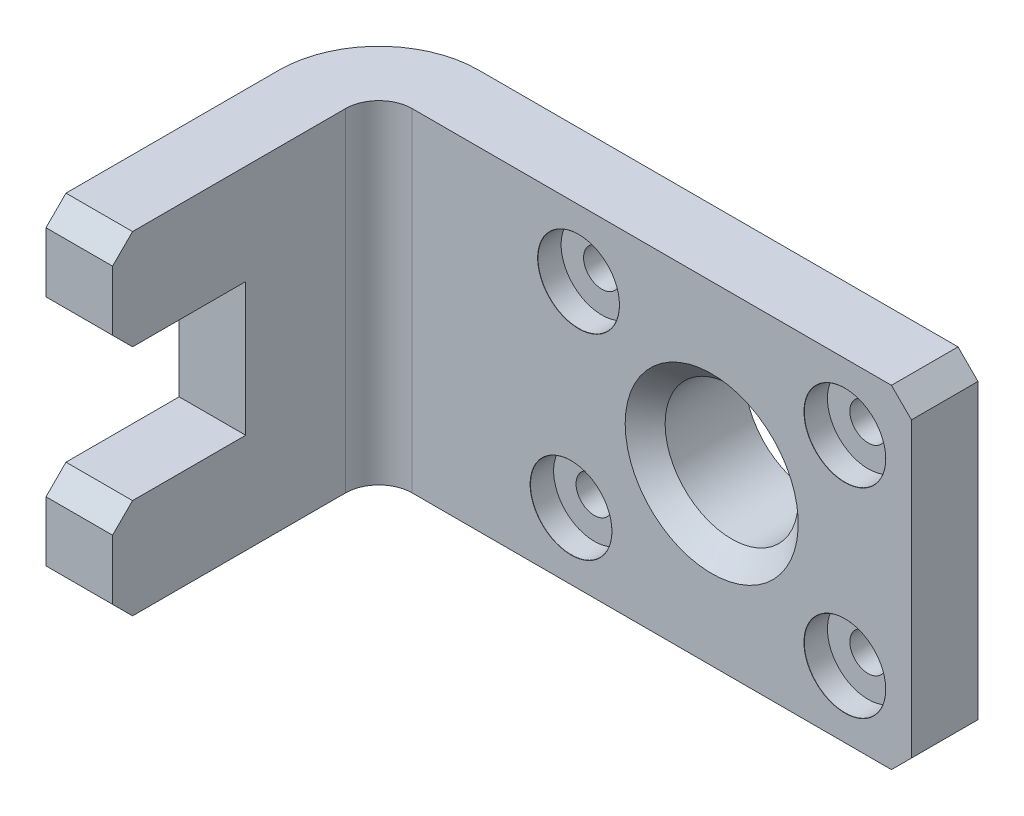
ISO-10303-21;
HEADER;
FILE_DESCRIPTION(('STEP AP214'),'2;1');
FILE_NAME('part.step','',(''),(''),'','','');
FILE_SCHEMA(('AUTOMOTIVE_DESIGN { 1 0 10303 214 1 1 1 1 }'));
ENDSEC;
DATA;
#1=APPLICATION_CONTEXT('core data for automotive mechanical design processes');
#2=APPLICATION_PROTOCOL_DEFINITION('international standard','automotive_design',2000,#1);
#3=PRODUCT_CONTEXT('',#1,'mechanical');
#4=PRODUCT('Part','Part','',(#3));
#5=PRODUCT_RELATED_PRODUCT_CATEGORY('part','',(#4));
#6=PRODUCT_DEFINITION_FORMATION('','',#4);
#7=PRODUCT_DEFINITION_CONTEXT('part definition',#1,'design');
#8=PRODUCT_DEFINITION('design','',#6,#7);
#9=PRODUCT_DEFINITION_SHAPE('','',#8);
#10=(LENGTH_UNIT() NAMED_UNIT(*) SI_UNIT(.MILLI.,.METRE.));
#11=(NAMED_UNIT(*) PLANE_ANGLE_UNIT() SI_UNIT($,.RADIAN.));
#12=(NAMED_UNIT(*) SI_UNIT($,.STERADIAN.) SOLID_ANGLE_UNIT());
#13=UNCERTAINTY_MEASURE_WITH_UNIT(LENGTH_MEASURE(1.E-05),#10,'distance_accuracy_value','');
#14=(GEOMETRIC_REPRESENTATION_CONTEXT(3) GLOBAL_UNCERTAINTY_ASSIGNED_CONTEXT((#13)) GLOBAL_UNIT_ASSIGNED_CONTEXT((#10,
#11,#12)) REPRESENTATION_CONTEXT('',''));
#15=CARTESIAN_POINT('',(0.,0.,0.));
#16=DIRECTION('',(0.,0.,1.));
#17=DIRECTION('',(1.,0.,0.));
#18=AXIS2_PLACEMENT_3D('',#15,#16,#17);
#19=CARTESIAN_POINT('',(0.,0.,0.));
#20=DIRECTION('',(1.,0.,0.));
#21=DIRECTION('',(0.,0.,-1.));
#22=AXIS2_PLACEMENT_3D('',#19,#20,#21);
#23=PLANE('',#22);
#24=DIRECTION('',(0.,0.,1.));
#25=VECTOR('',#24,1.);
#26=CARTESIAN_POINT('',(0.,0.,0.));
#27=LINE('',#26,#25);
#28=CARTESIAN_POINT('',(0.,0.,15.));
#29=VERTEX_POINT('',#28);
#30=CARTESIAN_POINT('',(0.,0.,47.));
#31=VERTEX_POINT('',#30);
#32=EDGE_CURVE('E235',#29,#31,#27,.T.);
#33=ORIENTED_EDGE('',*,*,#32,.F.);
#34=DIRECTION('',(0.,-1.,0.));
#35=VECTOR('',#34,1.);
#36=CARTESIAN_POINT('',(0.,0.,15.));
#37=LINE('',#36,#35);
#38=CARTESIAN_POINT('',(0.,50.,15.));
#39=VERTEX_POINT('',#38);
#40=EDGE_CURVE('E385',#29,#39,#37,.F.);
#41=ORIENTED_EDGE('',*,*,#40,.T.);
#42=DIRECTION('',(0.,0.,-1.));
#43=VECTOR('',#42,1.);
#44=CARTESIAN_POINT('',(0.,50.,0.));
#45=LINE('',#44,#43);
#46=CARTESIAN_POINT('',(0.,50.,47.));
#47=VERTEX_POINT('',#46);
#48=EDGE_CURVE('E227',#47,#39,#45,.T.);
#49=ORIENTED_EDGE('',*,*,#48,.F.);
#50=DIRECTION('',(0.,0.707106781186551,-0.707106781186544));
#51=VECTOR('',#50,1.);
#52=CARTESIAN_POINT('',(0.,48.4999999999998,48.5000000000002));
#53=LINE('',#52,#51);
#54=CARTESIAN_POINT('',(0.,47.,50.));
#55=VERTEX_POINT('',#54);
#56=EDGE_CURVE('E303',#47,#55,#53,.F.);
#57=ORIENTED_EDGE('',*,*,#56,.T.);
#58=DIRECTION('',(0.,1.,0.));
#59=VECTOR('',#58,1.);
#60=CARTESIAN_POINT('',(0.,0.,50.));
#61=LINE('',#60,#59);
#62=CARTESIAN_POINT('',(0.,38.,50.));
#63=VERTEX_POINT('',#62);
#64=EDGE_CURVE('E238',#63,#55,#61,.T.);
#65=ORIENTED_EDGE('',*,*,#64,.F.);
#66=DIRECTION('',(0.,-0.707106781186544,-0.707106781186551));
#67=VECTOR('',#66,1.);
#68=CARTESIAN_POINT('',(0.,-5.99999999999983,5.99999999999977));
#69=LINE('',#68,#67);
#70=CARTESIAN_POINT('',(0.,35.,47.));
#71=VERTEX_POINT('',#70);
#72=EDGE_CURVE('E318',#63,#71,#69,.T.);
#73=ORIENTED_EDGE('',*,*,#72,.T.);
#74=DIRECTION('',(0.,0.,1.));
#75=VECTOR('',#74,1.);
#76=CARTESIAN_POINT('',(0.,35.,30.));
#77=LINE('',#76,#75);
#78=CARTESIAN_POINT('',(0.,35.,30.));
#79=VERTEX_POINT('',#78);
#80=EDGE_CURVE('E218',#79,#71,#77,.T.);
#81=ORIENTED_EDGE('',*,*,#80,.F.);
#82=DIRECTION('',(0.,-1.,0.));
#83=VECTOR('',#82,1.);
#84=CARTESIAN_POINT('',(0.,35.,30.));
#85=LINE('',#84,#83);
#86=CARTESIAN_POINT('',(0.,15.,30.));
#87=VERTEX_POINT('',#86);
#88=EDGE_CURVE('E196',#79,#87,#85,.T.);
#89=ORIENTED_EDGE('',*,*,#88,.T.);
#90=DIRECTION('',(0.,0.,1.));
#91=VECTOR('',#90,1.);
#92=CARTESIAN_POINT('',(0.,15.,30.));
#93=LINE('',#92,#91);
#94=CARTESIAN_POINT('',(0.,15.,47.));
#95=VERTEX_POINT('',#94);
#96=EDGE_CURVE('E191',#87,#95,#93,.T.);
#97=ORIENTED_EDGE('',*,*,#96,.T.);
#98=DIRECTION('',(0.,0.707106781186551,-0.707106781186544));
#99=VECTOR('',#98,1.);
#100=CARTESIAN_POINT('',(0.,30.9999999999999,31.0000000000002));
#101=LINE('',#100,#99);
#102=CARTESIAN_POINT('',(0.,12.,50.));
#103=VERTEX_POINT('',#102);
#104=EDGE_CURVE('E366',#95,#103,#101,.F.);
#105=ORIENTED_EDGE('',*,*,#104,.T.);
#106=CARTESIAN_POINT('',(0.,3.,50.));
#107=VERTEX_POINT('',#106);
#108=EDGE_CURVE('E240',#107,#103,#61,.T.);
#109=ORIENTED_EDGE('',*,*,#108,.F.);
#110=DIRECTION('',(0.,0.707106781186544,0.707106781186551));
#111=VECTOR('',#110,1.);
#112=CARTESIAN_POINT('',(0.,-23.5,23.4999999999998));
#113=LINE('',#112,#111);
#114=EDGE_CURVE('E369',#107,#31,#113,.F.);
#115=ORIENTED_EDGE('',*,*,#114,.T.);
#116=EDGE_LOOP('',(#33,#41,#49,#57,#65,#73,#81,#89,#97,#105,#109,#115));
#117=FACE_BOUND('',#116,.T.);
#118=ADVANCED_FACE('F58',(#117),#23,.T.);
#119=CARTESIAN_POINT('',(-10.,0.,50.));
#120=DIRECTION('',(0.,0.,-1.));
#121=DIRECTION('',(-1.,0.,0.));
#122=AXIS2_PLACEMENT_3D('',#119,#120,#121);
#123=PLANE('',#122);
#124=DIRECTION('',(0.,1.,0.));
#125=VECTOR('',#124,1.);
#126=CARTESIAN_POINT('',(-10.,0.,50.));
#127=LINE('',#126,#125);
#128=CARTESIAN_POINT('',(-10.,38.,50.));
#129=VERTEX_POINT('',#128);
#130=CARTESIAN_POINT('',(-10.,47.,50.));
#131=VERTEX_POINT('',#130);
#132=EDGE_CURVE('E226',#129,#131,#127,.T.);
#133=ORIENTED_EDGE('',*,*,#132,.F.);
#134=DIRECTION('',(1.,0.,0.));
#135=VECTOR('',#134,1.);
#136=CARTESIAN_POINT('',(0.,38.,50.));
#137=LINE('',#136,#135);
#138=EDGE_CURVE('E314',#129,#63,#137,.T.);
#139=ORIENTED_EDGE('',*,*,#138,.T.);
#140=ORIENTED_EDGE('',*,*,#64,.T.);
#141=DIRECTION('',(-1.,0.,0.));
#142=VECTOR('',#141,1.);
#143=CARTESIAN_POINT('',(-10.,47.,50.));
#144=LINE('',#143,#142);
#145=EDGE_CURVE('E307',#55,#131,#144,.T.);
#146=ORIENTED_EDGE('',*,*,#145,.T.);
#147=EDGE_LOOP('',(#133,#139,#140,#146));
#148=FACE_BOUND('',#147,.T.);
#149=ADVANCED_FACE('F698',(#148),#123,.F.);
#150=CARTESIAN_POINT('',(-10.,0.,0.));
#151=DIRECTION('',(1.,0.,0.));
#152=DIRECTION('',(0.,0.,-1.));
#153=AXIS2_PLACEMENT_3D('',#150,#151,#152);
#154=PLANE('',#153);
#155=DIRECTION('',(0.,0.,-1.));
#156=VECTOR('',#155,1.);
#157=CARTESIAN_POINT('',(-10.,50.,0.));
#158=LINE('',#157,#156);
#159=CARTESIAN_POINT('',(-10.,50.,47.));
#160=VERTEX_POINT('',#159);
#161=CARTESIAN_POINT('',(-10.,50.,15.));
#162=VERTEX_POINT('',#161);
#163=EDGE_CURVE('E231',#160,#162,#158,.T.);
#164=ORIENTED_EDGE('',*,*,#163,.T.);
#165=DIRECTION('',(0.,-1.,0.));
#166=VECTOR('',#165,1.);
#167=CARTESIAN_POINT('',(-10.,0.,15.));
#168=LINE('',#167,#166);
#169=CARTESIAN_POINT('',(-10.,0.,15.));
#170=VERTEX_POINT('',#169);
#171=EDGE_CURVE('E394',#162,#170,#168,.T.);
#172=ORIENTED_EDGE('',*,*,#171,.T.);
#173=DIRECTION('',(0.,0.,1.));
#174=VECTOR('',#173,1.);
#175=CARTESIAN_POINT('',(-10.,0.,0.));
#176=LINE('',#175,#174);
#177=CARTESIAN_POINT('',(-10.,0.,47.));
#178=VERTEX_POINT('',#177);
#179=EDGE_CURVE('E223',#170,#178,#176,.T.);
#180=ORIENTED_EDGE('',*,*,#179,.T.);
#181=DIRECTION('',(0.,-0.707106781186544,-0.707106781186551));
#182=VECTOR('',#181,1.);
#183=CARTESIAN_POINT('',(-10.,3.,50.));
#184=LINE('',#183,#182);
#185=CARTESIAN_POINT('',(-10.,3.,50.));
#186=VERTEX_POINT('',#185);
#187=EDGE_CURVE('E375',#178,#186,#184,.F.);
#188=ORIENTED_EDGE('',*,*,#187,.T.);
#189=CARTESIAN_POINT('',(-10.,12.,50.));
#190=VERTEX_POINT('',#189);
#191=EDGE_CURVE('E228',#186,#190,#127,.T.);
#192=ORIENTED_EDGE('',*,*,#191,.T.);
#193=DIRECTION('',(0.,-0.707106781186551,0.707106781186544));
#194=VECTOR('',#193,1.);
#195=CARTESIAN_POINT('',(-10.,15.,47.));
#196=LINE('',#195,#194);
#197=CARTESIAN_POINT('',(-10.,15.,47.));
#198=VERTEX_POINT('',#197);
#199=EDGE_CURVE('E212',#190,#198,#196,.F.);
#200=ORIENTED_EDGE('',*,*,#199,.T.);
#201=DIRECTION('',(0.,0.,1.));
#202=VECTOR('',#201,1.);
#203=CARTESIAN_POINT('',(-10.,15.,30.));
#204=LINE('',#203,#202);
#205=CARTESIAN_POINT('',(-10.,15.,30.));
#206=VERTEX_POINT('',#205);
#207=EDGE_CURVE('E188',#206,#198,#204,.T.);
#208=ORIENTED_EDGE('',*,*,#207,.F.);
#209=DIRECTION('',(0.,-1.,0.));
#210=VECTOR('',#209,1.);
#211=CARTESIAN_POINT('',(-10.,35.,30.));
#212=LINE('',#211,#210);
#213=CARTESIAN_POINT('',(-10.,35.,30.));
#214=VERTEX_POINT('',#213);
#215=EDGE_CURVE('E197',#214,#206,#212,.T.);
#216=ORIENTED_EDGE('',*,*,#215,.F.);
#217=DIRECTION('',(0.,0.,1.));
#218=VECTOR('',#217,1.);
#219=CARTESIAN_POINT('',(-10.,35.,30.));
#220=LINE('',#219,#218);
#221=CARTESIAN_POINT('',(-10.,35.,47.));
#222=VERTEX_POINT('',#221);
#223=EDGE_CURVE('E239',#214,#222,#220,.T.);
#224=ORIENTED_EDGE('',*,*,#223,.T.);
#225=DIRECTION('',(0.,0.707106781186544,0.707106781186551));
#226=VECTOR('',#225,1.);
#227=CARTESIAN_POINT('',(-10.,38.,50.));
#228=LINE('',#227,#226);
#229=EDGE_CURVE('E324',#222,#129,#228,.T.);
#230=ORIENTED_EDGE('',*,*,#229,.T.);
#231=ORIENTED_EDGE('',*,*,#132,.T.);
#232=DIRECTION('',(0.,-0.707106781186551,0.707106781186544));
#233=VECTOR('',#232,1.);
#234=CARTESIAN_POINT('',(-10.,50.,47.));
#235=LINE('',#234,#233);
#236=EDGE_CURVE('E311',#131,#160,#235,.F.);
#237=ORIENTED_EDGE('',*,*,#236,.T.);
#238=EDGE_LOOP('',(#164,#172,#180,#188,#192,#200,#208,#216,#224,#230,#231,#237));
#239=FACE_BOUND('',#238,.T.);
#240=ADVANCED_FACE('F209',(#239),#154,.F.);
#241=CARTESIAN_POINT('',(0.,0.,10.));
#242=DIRECTION('',(0.,1.,0.));
#243=DIRECTION('',(0.,0.,1.));
#244=AXIS2_PLACEMENT_3D('',#241,#242,#243);
#245=PLANE('',#244);
#246=ORIENTED_EDGE('',*,*,#179,.F.);
#247=CARTESIAN_POINT('',(5.,0.,15.));
#248=DIRECTION('',(0.,1.,0.));
#249=DIRECTION('',(0.,0.,1.));
#250=AXIS2_PLACEMENT_3D('',#247,#248,#249);
#251=CIRCLE('',#250,15.);
#252=CARTESIAN_POINT('',(5.,0.,0.));
#253=VERTEX_POINT('',#252);
#254=EDGE_CURVE('E81',#170,#253,#251,.F.);
#255=ORIENTED_EDGE('',*,*,#254,.T.);
#256=DIRECTION('',(1.,0.,0.));
#257=VECTOR('',#256,1.);
#258=CARTESIAN_POINT('',(0.,0.,0.));
#259=LINE('',#258,#257);
#260=CARTESIAN_POINT('',(77.,0.,0.));
#261=VERTEX_POINT('',#260);
#262=EDGE_CURVE('E234',#253,#261,#259,.T.);
#263=ORIENTED_EDGE('',*,*,#262,.T.);
#264=DIRECTION('',(0.,0.,1.));
#265=VECTOR('',#264,1.);
#266=CARTESIAN_POINT('',(77.,0.,10.));
#267=LINE('',#266,#265);
#268=CARTESIAN_POINT('',(77.,0.,10.));
#269=VERTEX_POINT('',#268);
#270=EDGE_CURVE('E355',#261,#269,#267,.T.);
#271=ORIENTED_EDGE('',*,*,#270,.T.);
#272=DIRECTION('',(1.,0.,0.));
#273=VECTOR('',#272,1.);
#274=CARTESIAN_POINT('',(0.,0.,10.));
#275=LINE('',#274,#273);
#276=CARTESIAN_POINT('',(5.,0.,10.));
#277=VERTEX_POINT('',#276);
#278=EDGE_CURVE('E247',#277,#269,#275,.T.);
#279=ORIENTED_EDGE('',*,*,#278,.F.);
#280=CARTESIAN_POINT('',(5.,0.,15.));
#281=DIRECTION('',(0.,1.,0.));
#282=DIRECTION('',(0.,0.,1.));
#283=AXIS2_PLACEMENT_3D('',#280,#281,#282);
#284=CIRCLE('',#283,5.);
#285=EDGE_CURVE('E388',#277,#29,#284,.T.);
#286=ORIENTED_EDGE('',*,*,#285,.T.);
#287=ORIENTED_EDGE('',*,*,#32,.T.);
#288=DIRECTION('',(-1.,0.,0.));
#289=VECTOR('',#288,1.);
#290=CARTESIAN_POINT('',(0.,0.,47.));
#291=LINE('',#290,#289);
#292=EDGE_CURVE('E351',#31,#178,#291,.T.);
#293=ORIENTED_EDGE('',*,*,#292,.T.);
#294=EDGE_LOOP('',(#246,#255,#263,#271,#279,#286,#287,#293));
#295=FACE_BOUND('',#294,.T.);
#296=ADVANCED_FACE('F660',(#295),#245,.F.);
#297=CARTESIAN_POINT('',(80.,0.,10.));
#298=DIRECTION('',(-1.,0.,0.));
#299=DIRECTION('',(0.,0.,1.));
#300=AXIS2_PLACEMENT_3D('',#297,#298,#299);
#301=PLANE('',#300);
#302=DIRECTION('',(0.,1.,0.));
#303=VECTOR('',#302,1.);
#304=CARTESIAN_POINT('',(80.,0.,0.));
#305=LINE('',#304,#303);
#306=CARTESIAN_POINT('',(80.,3.,0.));
#307=VERTEX_POINT('',#306);
#308=CARTESIAN_POINT('',(80.,47.,0.));
#309=VERTEX_POINT('',#308);
#310=EDGE_CURVE('E262',#307,#309,#305,.T.);
#311=ORIENTED_EDGE('',*,*,#310,.T.);
#312=DIRECTION('',(0.,0.,1.));
#313=VECTOR('',#312,1.);
#314=CARTESIAN_POINT('',(80.,47.,10.));
#315=LINE('',#314,#313);
#316=CARTESIAN_POINT('',(80.,47.,10.));
#317=VERTEX_POINT('',#316);
#318=EDGE_CURVE('E342',#309,#317,#315,.T.);
#319=ORIENTED_EDGE('',*,*,#318,.T.);
#320=DIRECTION('',(0.,1.,0.));
#321=VECTOR('',#320,1.);
#322=CARTESIAN_POINT('',(80.,0.,10.));
#323=LINE('',#322,#321);
#324=CARTESIAN_POINT('',(80.,3.,10.));
#325=VERTEX_POINT('',#324);
#326=EDGE_CURVE('E250',#325,#317,#323,.T.);
#327=ORIENTED_EDGE('',*,*,#326,.F.);
#328=DIRECTION('',(0.,0.,-1.));
#329=VECTOR('',#328,1.);
#330=CARTESIAN_POINT('',(80.,3.,10.));
#331=LINE('',#330,#329);
#332=EDGE_CURVE('E338',#325,#307,#331,.T.);
#333=ORIENTED_EDGE('',*,*,#332,.T.);
#334=EDGE_LOOP('',(#311,#319,#327,#333));
#335=FACE_BOUND('',#334,.T.);
#336=ADVANCED_FACE('F679',(#335),#301,.F.);
#337=CARTESIAN_POINT('',(0.,50.,10.));
#338=DIRECTION('',(0.,-1.,0.));
#339=DIRECTION('',(0.,0.,-1.));
#340=AXIS2_PLACEMENT_3D('',#337,#338,#339);
#341=PLANE('',#340);
#342=DIRECTION('',(-1.,0.,0.));
#343=VECTOR('',#342,1.);
#344=CARTESIAN_POINT('',(0.,50.,0.));
#345=LINE('',#344,#343);
#346=CARTESIAN_POINT('',(77.,50.,0.));
#347=VERTEX_POINT('',#346);
#348=CARTESIAN_POINT('',(5.,50.,0.));
#349=VERTEX_POINT('',#348);
#350=EDGE_CURVE('E251',#347,#349,#345,.T.);
#351=ORIENTED_EDGE('',*,*,#350,.T.);
#352=CARTESIAN_POINT('',(5.,50.,15.));
#353=DIRECTION('',(0.,-1.,0.));
#354=DIRECTION('',(0.,0.,-1.));
#355=AXIS2_PLACEMENT_3D('',#352,#353,#354);
#356=CIRCLE('',#355,15.);
#357=EDGE_CURVE('E13',#349,#162,#356,.F.);
#358=ORIENTED_EDGE('',*,*,#357,.T.);
#359=ORIENTED_EDGE('',*,*,#163,.F.);
#360=DIRECTION('',(1.,0.,0.));
#361=VECTOR('',#360,1.);
#362=CARTESIAN_POINT('',(0.,50.,47.));
#363=LINE('',#362,#361);
#364=EDGE_CURVE('E275',#160,#47,#363,.T.);
#365=ORIENTED_EDGE('',*,*,#364,.T.);
#366=ORIENTED_EDGE('',*,*,#48,.T.);
#367=CARTESIAN_POINT('',(5.,50.,15.));
#368=DIRECTION('',(0.,-1.,0.));
#369=DIRECTION('',(0.,0.,-1.));
#370=AXIS2_PLACEMENT_3D('',#367,#368,#369);
#371=CIRCLE('',#370,5.);
#372=CARTESIAN_POINT('',(5.,50.,10.));
#373=VERTEX_POINT('',#372);
#374=EDGE_CURVE('E391',#39,#373,#371,.T.);
#375=ORIENTED_EDGE('',*,*,#374,.T.);
#376=DIRECTION('',(-1.,0.,0.));
#377=VECTOR('',#376,1.);
#378=CARTESIAN_POINT('',(0.,50.,10.));
#379=LINE('',#378,#377);
#380=CARTESIAN_POINT('',(77.,50.,10.));
#381=VERTEX_POINT('',#380);
#382=EDGE_CURVE('E255',#381,#373,#379,.T.);
#383=ORIENTED_EDGE('',*,*,#382,.F.);
#384=DIRECTION('',(0.,0.,-1.));
#385=VECTOR('',#384,1.);
#386=CARTESIAN_POINT('',(77.,50.,10.));
#387=LINE('',#386,#385);
#388=EDGE_CURVE('E327',#381,#347,#387,.T.);
#389=ORIENTED_EDGE('',*,*,#388,.T.);
#390=EDGE_LOOP('',(#351,#358,#359,#365,#366,#375,#383,#389));
#391=FACE_BOUND('',#390,.T.);
#392=ADVANCED_FACE('F639',(#391),#341,.F.);
#393=CARTESIAN_POINT('',(0.,0.,10.));
#394=DIRECTION('',(0.,0.,-1.));
#395=DIRECTION('',(-1.,0.,0.));
#396=AXIS2_PLACEMENT_3D('',#393,#394,#395);
#397=PLANE('',#396);
#398=CARTESIAN_POINT('',(70.,40.,10.));
#399=DIRECTION('',(0.,0.,1.));
#400=DIRECTION('',(1.,0.,0.));
#401=AXIS2_PLACEMENT_3D('',#398,#399,#400);
#402=CIRCLE('',#401,6.144);
#403=CARTESIAN_POINT('',(76.144,40.,10.));
#404=VERTEX_POINT('',#403);
#405=EDGE_CURVE('E625',#404,#404,#402,.T.);
#406=ORIENTED_EDGE('',*,*,#405,.F.);
#407=EDGE_LOOP('',(#406));
#408=FACE_BOUND('',#407,.T.);
#409=CARTESIAN_POINT('',(70.,10.,10.));
#410=DIRECTION('',(0.,0.,1.));
#411=DIRECTION('',(1.,0.,0.));
#412=AXIS2_PLACEMENT_3D('',#409,#410,#411);
#413=CIRCLE('',#412,6.144);
#414=CARTESIAN_POINT('',(76.144,10.,10.));
#415=VERTEX_POINT('',#414);
#416=EDGE_CURVE('E298',#415,#415,#413,.T.);
#417=ORIENTED_EDGE('',*,*,#416,.F.);
#418=EDGE_LOOP('',(#417));
#419=FACE_BOUND('',#418,.T.);
#420=CARTESIAN_POINT('',(28.8695652173913,10.,10.));
#421=DIRECTION('',(0.,0.,1.));
#422=DIRECTION('',(1.,0.,0.));
#423=AXIS2_PLACEMENT_3D('',#420,#421,#422);
#424=CIRCLE('',#423,6.144);
#425=CARTESIAN_POINT('',(35.0135652173913,10.,10.));
#426=VERTEX_POINT('',#425);
#427=EDGE_CURVE('E292',#426,#426,#424,.T.);
#428=ORIENTED_EDGE('',*,*,#427,.F.);
#429=EDGE_LOOP('',(#428));
#430=FACE_BOUND('',#429,.T.);
#431=CARTESIAN_POINT('',(30.,40.,10.));
#432=DIRECTION('',(0.,0.,1.));
#433=DIRECTION('',(1.,0.,0.));
#434=AXIS2_PLACEMENT_3D('',#431,#432,#433);
#435=CIRCLE('',#434,6.144);
#436=CARTESIAN_POINT('',(36.144,40.,10.));
#437=VERTEX_POINT('',#436);
#438=EDGE_CURVE('E286',#437,#437,#435,.T.);
#439=ORIENTED_EDGE('',*,*,#438,.F.);
#440=EDGE_LOOP('',(#439));
#441=FACE_BOUND('',#440,.T.);
#442=CARTESIAN_POINT('',(50.,25.,10.));
#443=DIRECTION('',(0.,0.,-1.));
#444=DIRECTION('',(-1.,0.,0.));
#445=AXIS2_PLACEMENT_3D('',#442,#443,#444);
#446=CIRCLE('',#445,13.);
#447=CARTESIAN_POINT('',(37.,25.,10.));
#448=VERTEX_POINT('',#447);
#449=EDGE_CURVE('E259',#448,#448,#446,.T.);
#450=ORIENTED_EDGE('',*,*,#449,.T.);
#451=EDGE_LOOP('',(#450));
#452=FACE_BOUND('',#451,.T.);
#453=ORIENTED_EDGE('',*,*,#382,.T.);
#454=DIRECTION('',(0.,-1.,0.));
#455=VECTOR('',#454,1.);
#456=CARTESIAN_POINT('',(5.,0.,10.));
#457=LINE('',#456,#455);
#458=EDGE_CURVE('E381',#373,#277,#457,.T.);
#459=ORIENTED_EDGE('',*,*,#458,.T.);
#460=ORIENTED_EDGE('',*,*,#278,.T.);
#461=DIRECTION('',(-0.707106781186551,-0.707106781186544,0.));
#462=VECTOR('',#461,1.);
#463=CARTESIAN_POINT('',(80.,3.,10.));
#464=LINE('',#463,#462);
#465=EDGE_CURVE('E345',#269,#325,#464,.F.);
#466=ORIENTED_EDGE('',*,*,#465,.T.);
#467=ORIENTED_EDGE('',*,*,#326,.T.);
#468=DIRECTION('',(0.707106781186544,-0.707106781186551,0.));
#469=VECTOR('',#468,1.);
#470=CARTESIAN_POINT('',(77.,50.,10.));
#471=LINE('',#470,#469);
#472=EDGE_CURVE('E348',#317,#381,#471,.F.);
#473=ORIENTED_EDGE('',*,*,#472,.T.);
#474=EDGE_LOOP('',(#453,#459,#460,#466,#467,#473));
#475=FACE_BOUND('',#474,.T.);
#476=ADVANCED_FACE('F635',(#408,#419,#430,#441,#452,#475),#397,.F.);
#477=CARTESIAN_POINT('',(0.,0.,0.));
#478=DIRECTION('',(0.,0.,-1.));
#479=DIRECTION('',(-1.,0.,0.));
#480=AXIS2_PLACEMENT_3D('',#477,#478,#479);
#481=PLANE('',#480);
#482=CARTESIAN_POINT('',(70.,40.,0.));
#483=DIRECTION('',(0.,0.,-1.));
#484=DIRECTION('',(-1.,0.,0.));
#485=AXIS2_PLACEMENT_3D('',#482,#483,#484);
#486=CIRCLE('',#485,2.75);
#487=CARTESIAN_POINT('',(67.25,40.,0.));
#488=VERTEX_POINT('',#487);
#489=EDGE_CURVE('E294',#488,#488,#486,.T.);
#490=ORIENTED_EDGE('',*,*,#489,.F.);
#491=EDGE_LOOP('',(#490));
#492=FACE_BOUND('',#491,.T.);
#493=CARTESIAN_POINT('',(70.,10.,0.));
#494=DIRECTION('',(0.,0.,-1.));
#495=DIRECTION('',(-1.,0.,0.));
#496=AXIS2_PLACEMENT_3D('',#493,#494,#495);
#497=CIRCLE('',#496,2.75);
#498=CARTESIAN_POINT('',(67.25,10.,0.));
#499=VERTEX_POINT('',#498);
#500=EDGE_CURVE('E288',#499,#499,#497,.T.);
#501=ORIENTED_EDGE('',*,*,#500,.F.);
#502=EDGE_LOOP('',(#501));
#503=FACE_BOUND('',#502,.T.);
#504=CARTESIAN_POINT('',(28.8695652173913,10.,0.));
#505=DIRECTION('',(0.,0.,-1.));
#506=DIRECTION('',(-1.,0.,0.));
#507=AXIS2_PLACEMENT_3D('',#504,#505,#506);
#508=CIRCLE('',#507,2.75);
#509=CARTESIAN_POINT('',(26.1195652173913,10.,0.));
#510=VERTEX_POINT('',#509);
#511=EDGE_CURVE('E282',#510,#510,#508,.T.);
#512=ORIENTED_EDGE('',*,*,#511,.F.);
#513=EDGE_LOOP('',(#512));
#514=FACE_BOUND('',#513,.T.);
#515=CARTESIAN_POINT('',(30.,40.,0.));
#516=DIRECTION('',(0.,0.,-1.));
#517=DIRECTION('',(-1.,0.,0.));
#518=AXIS2_PLACEMENT_3D('',#515,#516,#517);
#519=CIRCLE('',#518,2.75);
#520=CARTESIAN_POINT('',(27.25,40.,0.));
#521=VERTEX_POINT('',#520);
#522=EDGE_CURVE('E276',#521,#521,#519,.T.);
#523=ORIENTED_EDGE('',*,*,#522,.F.);
#524=EDGE_LOOP('',(#523));
#525=FACE_BOUND('',#524,.T.);
#526=CARTESIAN_POINT('',(50.,25.,0.));
#527=DIRECTION('',(0.,0.,-1.));
#528=DIRECTION('',(-1.,0.,0.));
#529=AXIS2_PLACEMENT_3D('',#526,#527,#528);
#530=CIRCLE('',#529,15.);
#531=CARTESIAN_POINT('',(35.,25.,0.));
#532=VERTEX_POINT('',#531);
#533=EDGE_CURVE('E523',#532,#532,#530,.T.);
#534=ORIENTED_EDGE('',*,*,#533,.F.);
#535=EDGE_LOOP('',(#534));
#536=FACE_BOUND('',#535,.T.);
#537=ORIENTED_EDGE('',*,*,#262,.F.);
#538=DIRECTION('',(0.,-1.,0.));
#539=VECTOR('',#538,1.);
#540=CARTESIAN_POINT('',(5.,50.,0.));
#541=LINE('',#540,#539);
#542=EDGE_CURVE('E67',#253,#349,#541,.F.);
#543=ORIENTED_EDGE('',*,*,#542,.T.);
#544=ORIENTED_EDGE('',*,*,#350,.F.);
#545=DIRECTION('',(-0.707106781186544,0.707106781186551,0.));
#546=VECTOR('',#545,1.);
#547=CARTESIAN_POINT('',(63.5000000000004,63.4999999999998,0.));
#548=LINE('',#547,#546);
#549=EDGE_CURVE('E335',#347,#309,#548,.F.);
#550=ORIENTED_EDGE('',*,*,#549,.T.);
#551=ORIENTED_EDGE('',*,*,#310,.F.);
#552=DIRECTION('',(0.707106781186551,0.707106781186544,0.));
#553=VECTOR('',#552,1.);
#554=CARTESIAN_POINT('',(38.4999999999996,-38.5,0.));
#555=LINE('',#554,#553);
#556=EDGE_CURVE('E331',#307,#261,#555,.F.);
#557=ORIENTED_EDGE('',*,*,#556,.T.);
#558=EDGE_LOOP('',(#537,#543,#544,#550,#551,#557));
#559=FACE_BOUND('',#558,.T.);
#560=ADVANCED_FACE('F638',(#492,#503,#514,#525,#536,#559),#481,.T.);
#561=ORIENTED_EDGE('',*,*,#191,.F.);
#562=DIRECTION('',(1.,0.,0.));
#563=VECTOR('',#562,1.);
#564=CARTESIAN_POINT('',(-10.,3.,50.));
#565=LINE('',#564,#563);
#566=EDGE_CURVE('E362',#186,#107,#565,.T.);
#567=ORIENTED_EDGE('',*,*,#566,.T.);
#568=ORIENTED_EDGE('',*,*,#108,.T.);
#569=DIRECTION('',(-1.,0.,0.));
#570=VECTOR('',#569,1.);
#571=CARTESIAN_POINT('',(-10.,12.,50.));
#572=LINE('',#571,#570);
#573=EDGE_CURVE('E359',#103,#190,#572,.T.);
#574=ORIENTED_EDGE('',*,*,#573,.T.);
#575=EDGE_LOOP('',(#561,#567,#568,#574));
#576=FACE_BOUND('',#575,.T.);
#577=ADVANCED_FACE('F705',(#576),#123,.F.);
#578=CARTESIAN_POINT('',(-10.,35.,30.));
#579=DIRECTION('',(0.,-1.,0.));
#580=DIRECTION('',(0.,0.,-1.));
#581=AXIS2_PLACEMENT_3D('',#578,#579,#580);
#582=PLANE('',#581);
#583=ORIENTED_EDGE('',*,*,#80,.T.);
#584=DIRECTION('',(-1.,0.,0.));
#585=VECTOR('',#584,1.);
#586=CARTESIAN_POINT('',(-10.,35.,47.));
#587=LINE('',#586,#585);
#588=EDGE_CURVE('E321',#71,#222,#587,.T.);
#589=ORIENTED_EDGE('',*,*,#588,.T.);
#590=ORIENTED_EDGE('',*,*,#223,.F.);
#591=DIRECTION('',(1.,0.,0.));
#592=VECTOR('',#591,1.);
#593=CARTESIAN_POINT('',(-10.,35.,30.));
#594=LINE('',#593,#592);
#595=EDGE_CURVE('E201',#214,#79,#594,.T.);
#596=ORIENTED_EDGE('',*,*,#595,.T.);
#597=EDGE_LOOP('',(#583,#589,#590,#596));
#598=FACE_BOUND('',#597,.T.);
#599=ADVANCED_FACE('F709',(#598),#582,.T.);
#600=CARTESIAN_POINT('',(-10.,15.,30.));
#601=DIRECTION('',(0.,-1.,0.));
#602=DIRECTION('',(0.,0.,-1.));
#603=AXIS2_PLACEMENT_3D('',#600,#601,#602);
#604=PLANE('',#603);
#605=ORIENTED_EDGE('',*,*,#207,.T.);
#606=DIRECTION('',(1.,0.,0.));
#607=VECTOR('',#606,1.);
#608=CARTESIAN_POINT('',(-10.,15.,47.));
#609=LINE('',#608,#607);
#610=EDGE_CURVE('E378',#198,#95,#609,.T.);
#611=ORIENTED_EDGE('',*,*,#610,.T.);
#612=ORIENTED_EDGE('',*,*,#96,.F.);
#613=DIRECTION('',(1.,0.,0.));
#614=VECTOR('',#613,1.);
#615=CARTESIAN_POINT('',(-10.,15.,30.));
#616=LINE('',#615,#614);
#617=EDGE_CURVE('E183',#206,#87,#616,.T.);
#618=ORIENTED_EDGE('',*,*,#617,.F.);
#619=EDGE_LOOP('',(#605,#611,#612,#618));
#620=FACE_BOUND('',#619,.T.);
#621=ADVANCED_FACE('F185',(#620),#604,.F.);
#622=CARTESIAN_POINT('',(0.,0.,30.));
#623=DIRECTION('',(0.,0.,1.));
#624=DIRECTION('',(1.,0.,0.));
#625=AXIS2_PLACEMENT_3D('',#622,#623,#624);
#626=PLANE('',#625);
#627=ORIENTED_EDGE('',*,*,#215,.T.);
#628=ORIENTED_EDGE('',*,*,#617,.T.);
#629=ORIENTED_EDGE('',*,*,#88,.F.);
#630=ORIENTED_EDGE('',*,*,#595,.F.);
#631=EDGE_LOOP('',(#627,#628,#629,#630));
#632=FACE_BOUND('',#631,.T.);
#633=ADVANCED_FACE('F200',(#632),#626,.T.);
#634=CARTESIAN_POINT('',(50.,25.,-5.));
#635=DIRECTION('',(0.,0.,1.));
#636=DIRECTION('',(1.,0.,0.));
#637=AXIS2_PLACEMENT_3D('',#634,#635,#636);
#638=CYLINDRICAL_SURFACE('',#637,15.);
#639=CARTESIAN_POINT('',(50.,25.,-5.));
#640=DIRECTION('',(0.,0.,-1.));
#641=DIRECTION('',(-1.,0.,0.));
#642=AXIS2_PLACEMENT_3D('',#639,#640,#641);
#643=CIRCLE('',#642,15.);
#644=CARTESIAN_POINT('',(35.,25.,-5.));
#645=VERTEX_POINT('',#644);
#646=EDGE_CURVE('E206',#645,#645,#643,.T.);
#647=ORIENTED_EDGE('',*,*,#646,.F.);
#648=EDGE_LOOP('',(#647));
#649=FACE_BOUND('',#648,.T.);
#650=ORIENTED_EDGE('',*,*,#533,.T.);
#651=EDGE_LOOP('',(#650));
#652=FACE_BOUND('',#651,.T.);
#653=ADVANCED_FACE('F1088',(#649,#652),#638,.T.);
#654=CARTESIAN_POINT('',(50.,25.,-5.));
#655=DIRECTION('',(0.,0.,-1.));
#656=DIRECTION('',(-1.,0.,0.));
#657=AXIS2_PLACEMENT_3D('',#654,#655,#656);
#658=PLANE('',#657);
#659=CARTESIAN_POINT('',(50.,25.,-5.));
#660=DIRECTION('',(0.,0.,-1.));
#661=DIRECTION('',(-1.,0.,0.));
#662=AXIS2_PLACEMENT_3D('',#659,#660,#661);
#663=CIRCLE('',#662,10.);
#664=CARTESIAN_POINT('',(40.,25.,-5.));
#665=VERTEX_POINT('',#664);
#666=EDGE_CURVE('E280',#665,#665,#663,.T.);
#667=ORIENTED_EDGE('',*,*,#666,.F.);
#668=EDGE_LOOP('',(#667));
#669=FACE_BOUND('',#668,.T.);
#670=ORIENTED_EDGE('',*,*,#646,.T.);
#671=EDGE_LOOP('',(#670));
#672=FACE_BOUND('',#671,.T.);
#673=ADVANCED_FACE('F1077',(#669,#672),#658,.T.);
#674=CARTESIAN_POINT('',(50.,25.,10.));
#675=DIRECTION('',(0.,0.,-1.));
#676=DIRECTION('',(-1.,0.,0.));
#677=AXIS2_PLACEMENT_3D('',#674,#675,#676);
#678=CYLINDRICAL_SURFACE('',#677,10.);
#679=CARTESIAN_POINT('',(50.,25.,7.00000000000001));
#680=DIRECTION('',(0.,0.,-1.));
#681=DIRECTION('',(-1.,0.,0.));
#682=AXIS2_PLACEMENT_3D('',#679,#680,#681);
#683=CIRCLE('',#682,10.);
#684=CARTESIAN_POINT('',(40.,25.,7.00000000000001));
#685=VERTEX_POINT('',#684);
#686=EDGE_CURVE('E271',#685,#685,#683,.F.);
#687=ORIENTED_EDGE('',*,*,#686,.T.);
#688=EDGE_LOOP('',(#687));
#689=FACE_BOUND('',#688,.T.);
#690=ORIENTED_EDGE('',*,*,#666,.T.);
#691=EDGE_LOOP('',(#690));
#692=FACE_BOUND('',#691,.T.);
#693=ADVANCED_FACE('F729',(#689,#692),#678,.F.);
#694=CARTESIAN_POINT('',(50.,25.,10.));
#695=DIRECTION('',(0.,0.,1.));
#696=DIRECTION('',(1.,0.,0.));
#697=AXIS2_PLACEMENT_3D('',#694,#695,#696);
#698=CONICAL_SURFACE('',#697,13.,0.785398163397449);
#699=ORIENTED_EDGE('',*,*,#686,.F.);
#700=EDGE_LOOP('',(#699));
#701=FACE_BOUND('',#700,.T.);
#702=ORIENTED_EDGE('',*,*,#449,.F.);
#703=EDGE_LOOP('',(#702));
#704=FACE_BOUND('',#703,.T.);
#705=ADVANCED_FACE('F722',(#701,#704),#698,.F.);
#706=CARTESIAN_POINT('',(30.,40.,10.));
#707=DIRECTION('',(0.,0.,1.));
#708=DIRECTION('',(1.,0.,0.));
#709=AXIS2_PLACEMENT_3D('',#706,#707,#708);
#710=CYLINDRICAL_SURFACE('',#709,2.75);
#711=ORIENTED_EDGE('',*,*,#522,.T.);
#712=EDGE_LOOP('',(#711));
#713=FACE_BOUND('',#712,.T.);
#714=CARTESIAN_POINT('',(30.,40.,6.50000000000001));
#715=DIRECTION('',(0.,0.,1.));
#716=DIRECTION('',(1.,0.,0.));
#717=AXIS2_PLACEMENT_3D('',#714,#715,#716);
#718=CIRCLE('',#717,2.75000000000001);
#719=CARTESIAN_POINT('',(32.75,40.,6.50000000000001));
#720=VERTEX_POINT('',#719);
#721=EDGE_CURVE('E281',#720,#720,#718,.T.);
#722=ORIENTED_EDGE('',*,*,#721,.T.);
#723=EDGE_LOOP('',(#722));
#724=FACE_BOUND('',#723,.T.);
#725=ADVANCED_FACE('F728',(#713,#724),#710,.F.);
#726=CARTESIAN_POINT('',(36.119,40.,6.50000000000001));
#727=DIRECTION('',(0.,0.,-1.));
#728=DIRECTION('',(-1.,0.,0.));
#729=AXIS2_PLACEMENT_3D('',#726,#727,#728);
#730=PLANE('',#729);
#731=ORIENTED_EDGE('',*,*,#721,.F.);
#732=EDGE_LOOP('',(#731));
#733=FACE_BOUND('',#732,.T.);
#734=CARTESIAN_POINT('',(30.,40.,6.50000000000001));
#735=DIRECTION('',(0.,0.,1.));
#736=DIRECTION('',(1.,0.,0.));
#737=AXIS2_PLACEMENT_3D('',#734,#735,#736);
#738=CIRCLE('',#737,6.119);
#739=CARTESIAN_POINT('',(36.119,40.,6.50000000000001));
#740=VERTEX_POINT('',#739);
#741=EDGE_CURVE('E541',#740,#740,#738,.T.);
#742=ORIENTED_EDGE('',*,*,#741,.T.);
#743=EDGE_LOOP('',(#742));
#744=FACE_BOUND('',#743,.T.);
#745=ADVANCED_FACE('F1039',(#733,#744),#730,.F.);
#746=CARTESIAN_POINT('',(30.,40.,10.));
#747=DIRECTION('',(0.,0.,1.));
#748=DIRECTION('',(1.,0.,0.));
#749=AXIS2_PLACEMENT_3D('',#746,#747,#748);
#750=CYLINDRICAL_SURFACE('',#749,6.119);
#751=ORIENTED_EDGE('',*,*,#741,.F.);
#752=EDGE_LOOP('',(#751));
#753=FACE_BOUND('',#752,.T.);
#754=CARTESIAN_POINT('',(30.,40.,9.97902250922057));
#755=DIRECTION('',(0.,0.,1.));
#756=DIRECTION('',(1.,0.,0.));
#757=AXIS2_PLACEMENT_3D('',#754,#755,#756);
#758=CIRCLE('',#757,6.119);
#759=CARTESIAN_POINT('',(36.119,40.,9.97902250922057));
#760=VERTEX_POINT('',#759);
#761=EDGE_CURVE('E547',#760,#760,#758,.T.);
#762=ORIENTED_EDGE('',*,*,#761,.T.);
#763=EDGE_LOOP('',(#762));
#764=FACE_BOUND('',#763,.T.);
#765=ADVANCED_FACE('F1028',(#753,#764),#750,.F.);
#766=CARTESIAN_POINT('',(30.,40.,10.));
#767=DIRECTION('',(0.,0.,1.));
#768=DIRECTION('',(1.,0.,0.));
#769=AXIS2_PLACEMENT_3D('',#766,#767,#768);
#770=CONICAL_SURFACE('',#769,6.144,0.87266462599705);
#771=ORIENTED_EDGE('',*,*,#761,.F.);
#772=EDGE_LOOP('',(#771));
#773=FACE_BOUND('',#772,.T.);
#774=ORIENTED_EDGE('',*,*,#438,.T.);
#775=EDGE_LOOP('',(#774));
#776=FACE_BOUND('',#775,.T.);
#777=ADVANCED_FACE('F1017',(#773,#776),#770,.F.);
#778=CARTESIAN_POINT('',(28.8695652173913,10.,10.));
#779=DIRECTION('',(0.,0.,1.));
#780=DIRECTION('',(1.,0.,0.));
#781=AXIS2_PLACEMENT_3D('',#778,#779,#780);
#782=CYLINDRICAL_SURFACE('',#781,2.75);
#783=ORIENTED_EDGE('',*,*,#511,.T.);
#784=EDGE_LOOP('',(#783));
#785=FACE_BOUND('',#784,.T.);
#786=CARTESIAN_POINT('',(28.8695652173913,10.,6.50000000000001));
#787=DIRECTION('',(0.,0.,1.));
#788=DIRECTION('',(1.,0.,0.));
#789=AXIS2_PLACEMENT_3D('',#786,#787,#788);
#790=CIRCLE('',#789,2.75000000000001);
#791=CARTESIAN_POINT('',(31.6195652173913,10.,6.50000000000001));
#792=VERTEX_POINT('',#791);
#793=EDGE_CURVE('E287',#792,#792,#790,.T.);
#794=ORIENTED_EDGE('',*,*,#793,.T.);
#795=EDGE_LOOP('',(#794));
#796=FACE_BOUND('',#795,.T.);
#797=ADVANCED_FACE('F1006',(#785,#796),#782,.F.);
#798=CARTESIAN_POINT('',(34.9885652173913,10.,6.50000000000001));
#799=DIRECTION('',(0.,0.,-1.));
#800=DIRECTION('',(-1.,0.,0.));
#801=AXIS2_PLACEMENT_3D('',#798,#799,#800);
#802=PLANE('',#801);
#803=ORIENTED_EDGE('',*,*,#793,.F.);
#804=EDGE_LOOP('',(#803));
#805=FACE_BOUND('',#804,.T.);
#806=CARTESIAN_POINT('',(28.8695652173913,10.,6.50000000000001));
#807=DIRECTION('',(0.,0.,1.));
#808=DIRECTION('',(1.,0.,0.));
#809=AXIS2_PLACEMENT_3D('',#806,#807,#808);
#810=CIRCLE('',#809,6.119);
#811=CARTESIAN_POINT('',(34.9885652173913,10.,6.50000000000001));
#812=VERTEX_POINT('',#811);
#813=EDGE_CURVE('E565',#812,#812,#810,.T.);
#814=ORIENTED_EDGE('',*,*,#813,.T.);
#815=EDGE_LOOP('',(#814));
#816=FACE_BOUND('',#815,.T.);
#817=ADVANCED_FACE('F995',(#805,#816),#802,.F.);
#818=CARTESIAN_POINT('',(28.8695652173913,10.,10.));
#819=DIRECTION('',(0.,0.,1.));
#820=DIRECTION('',(1.,0.,0.));
#821=AXIS2_PLACEMENT_3D('',#818,#819,#820);
#822=CYLINDRICAL_SURFACE('',#821,6.119);
#823=ORIENTED_EDGE('',*,*,#813,.F.);
#824=EDGE_LOOP('',(#823));
#825=FACE_BOUND('',#824,.T.);
#826=CARTESIAN_POINT('',(28.8695652173913,10.,9.97902250922057));
#827=DIRECTION('',(0.,0.,1.));
#828=DIRECTION('',(1.,0.,0.));
#829=AXIS2_PLACEMENT_3D('',#826,#827,#828);
#830=CIRCLE('',#829,6.119);
#831=CARTESIAN_POINT('',(34.9885652173913,10.,9.97902250922057));
#832=VERTEX_POINT('',#831);
#833=EDGE_CURVE('E571',#832,#832,#830,.T.);
#834=ORIENTED_EDGE('',*,*,#833,.T.);
#835=EDGE_LOOP('',(#834));
#836=FACE_BOUND('',#835,.T.);
#837=ADVANCED_FACE('F984',(#825,#836),#822,.F.);
#838=CARTESIAN_POINT('',(28.8695652173913,10.,10.));
#839=DIRECTION('',(0.,0.,1.));
#840=DIRECTION('',(1.,0.,0.));
#841=AXIS2_PLACEMENT_3D('',#838,#839,#840);
#842=CONICAL_SURFACE('',#841,6.144,0.872664625997186);
#843=ORIENTED_EDGE('',*,*,#833,.F.);
#844=EDGE_LOOP('',(#843));
#845=FACE_BOUND('',#844,.T.);
#846=ORIENTED_EDGE('',*,*,#427,.T.);
#847=EDGE_LOOP('',(#846));
#848=FACE_BOUND('',#847,.T.);
#849=ADVANCED_FACE('F973',(#845,#848),#842,.F.);
#850=CARTESIAN_POINT('',(70.,10.,10.));
#851=DIRECTION('',(0.,0.,1.));
#852=DIRECTION('',(1.,0.,0.));
#853=AXIS2_PLACEMENT_3D('',#850,#851,#852);
#854=CYLINDRICAL_SURFACE('',#853,2.75);
#855=ORIENTED_EDGE('',*,*,#500,.T.);
#856=EDGE_LOOP('',(#855));
#857=FACE_BOUND('',#856,.T.);
#858=CARTESIAN_POINT('',(70.,10.,6.50000000000001));
#859=DIRECTION('',(0.,0.,1.));
#860=DIRECTION('',(1.,0.,0.));
#861=AXIS2_PLACEMENT_3D('',#858,#859,#860);
#862=CIRCLE('',#861,2.75);
#863=CARTESIAN_POINT('',(72.75,10.,6.50000000000001));
#864=VERTEX_POINT('',#863);
#865=EDGE_CURVE('E293',#864,#864,#862,.T.);
#866=ORIENTED_EDGE('',*,*,#865,.T.);
#867=EDGE_LOOP('',(#866));
#868=FACE_BOUND('',#867,.T.);
#869=ADVANCED_FACE('F962',(#857,#868),#854,.F.);
#870=CARTESIAN_POINT('',(76.119,10.,6.50000000000001));
#871=DIRECTION('',(0.,0.,-1.));
#872=DIRECTION('',(-1.,0.,0.));
#873=AXIS2_PLACEMENT_3D('',#870,#871,#872);
#874=PLANE('',#873);
#875=ORIENTED_EDGE('',*,*,#865,.F.);
#876=EDGE_LOOP('',(#875));
#877=FACE_BOUND('',#876,.T.);
#878=CARTESIAN_POINT('',(70.,10.,6.50000000000001));
#879=DIRECTION('',(0.,0.,1.));
#880=DIRECTION('',(1.,0.,0.));
#881=AXIS2_PLACEMENT_3D('',#878,#879,#880);
#882=CIRCLE('',#881,6.119);
#883=CARTESIAN_POINT('',(76.119,10.,6.50000000000001));
#884=VERTEX_POINT('',#883);
#885=EDGE_CURVE('E589',#884,#884,#882,.T.);
#886=ORIENTED_EDGE('',*,*,#885,.T.);
#887=EDGE_LOOP('',(#886));
#888=FACE_BOUND('',#887,.T.);
#889=ADVANCED_FACE('F951',(#877,#888),#874,.F.);
#890=CARTESIAN_POINT('',(70.,10.,10.));
#891=DIRECTION('',(0.,0.,1.));
#892=DIRECTION('',(1.,0.,0.));
#893=AXIS2_PLACEMENT_3D('',#890,#891,#892);
#894=CYLINDRICAL_SURFACE('',#893,6.119);
#895=ORIENTED_EDGE('',*,*,#885,.F.);
#896=EDGE_LOOP('',(#895));
#897=FACE_BOUND('',#896,.T.);
#898=CARTESIAN_POINT('',(70.,10.,9.97902250922057));
#899=DIRECTION('',(0.,0.,1.));
#900=DIRECTION('',(1.,0.,0.));
#901=AXIS2_PLACEMENT_3D('',#898,#899,#900);
#902=CIRCLE('',#901,6.119);
#903=CARTESIAN_POINT('',(76.119,10.,9.97902250922057));
#904=VERTEX_POINT('',#903);
#905=EDGE_CURVE('E595',#904,#904,#902,.T.);
#906=ORIENTED_EDGE('',*,*,#905,.T.);
#907=EDGE_LOOP('',(#906));
#908=FACE_BOUND('',#907,.T.);
#909=ADVANCED_FACE('F940',(#897,#908),#894,.F.);
#910=CARTESIAN_POINT('',(70.,10.,10.));
#911=DIRECTION('',(0.,0.,1.));
#912=DIRECTION('',(1.,0.,0.));
#913=AXIS2_PLACEMENT_3D('',#910,#911,#912);
#914=CONICAL_SURFACE('',#913,6.144,0.87266462599705);
#915=ORIENTED_EDGE('',*,*,#905,.F.);
#916=EDGE_LOOP('',(#915));
#917=FACE_BOUND('',#916,.T.);
#918=ORIENTED_EDGE('',*,*,#416,.T.);
#919=EDGE_LOOP('',(#918));
#920=FACE_BOUND('',#919,.T.);
#921=ADVANCED_FACE('F929',(#917,#920),#914,.F.);
#922=CARTESIAN_POINT('',(70.,40.,10.));
#923=DIRECTION('',(0.,0.,1.));
#924=DIRECTION('',(1.,0.,0.));
#925=AXIS2_PLACEMENT_3D('',#922,#923,#924);
#926=CYLINDRICAL_SURFACE('',#925,2.75);
#927=ORIENTED_EDGE('',*,*,#489,.T.);
#928=EDGE_LOOP('',(#927));
#929=FACE_BOUND('',#928,.T.);
#930=CARTESIAN_POINT('',(70.,40.,6.50000000000001));
#931=DIRECTION('',(0.,0.,1.));
#932=DIRECTION('',(1.,0.,0.));
#933=AXIS2_PLACEMENT_3D('',#930,#931,#932);
#934=CIRCLE('',#933,2.75);
#935=CARTESIAN_POINT('',(72.75,40.,6.50000000000001));
#936=VERTEX_POINT('',#935);
#937=EDGE_CURVE('E299',#936,#936,#934,.T.);
#938=ORIENTED_EDGE('',*,*,#937,.T.);
#939=EDGE_LOOP('',(#938));
#940=FACE_BOUND('',#939,.T.);
#941=ADVANCED_FACE('F918',(#929,#940),#926,.F.);
#942=CARTESIAN_POINT('',(76.119,40.,6.50000000000001));
#943=DIRECTION('',(0.,0.,-1.));
#944=DIRECTION('',(-1.,0.,0.));
#945=AXIS2_PLACEMENT_3D('',#942,#943,#944);
#946=PLANE('',#945);
#947=ORIENTED_EDGE('',*,*,#937,.F.);
#948=EDGE_LOOP('',(#947));
#949=FACE_BOUND('',#948,.T.);
#950=CARTESIAN_POINT('',(70.,40.,6.50000000000001));
#951=DIRECTION('',(0.,0.,1.));
#952=DIRECTION('',(1.,0.,0.));
#953=AXIS2_PLACEMENT_3D('',#950,#951,#952);
#954=CIRCLE('',#953,6.119);
#955=CARTESIAN_POINT('',(76.119,40.,6.50000000000001));
#956=VERTEX_POINT('',#955);
#957=EDGE_CURVE('E613',#956,#956,#954,.T.);
#958=ORIENTED_EDGE('',*,*,#957,.T.);
#959=EDGE_LOOP('',(#958));
#960=FACE_BOUND('',#959,.T.);
#961=ADVANCED_FACE('F907',(#949,#960),#946,.F.);
#962=CARTESIAN_POINT('',(70.,40.,10.));
#963=DIRECTION('',(0.,0.,1.));
#964=DIRECTION('',(1.,0.,0.));
#965=AXIS2_PLACEMENT_3D('',#962,#963,#964);
#966=CYLINDRICAL_SURFACE('',#965,6.119);
#967=ORIENTED_EDGE('',*,*,#957,.F.);
#968=EDGE_LOOP('',(#967));
#969=FACE_BOUND('',#968,.T.);
#970=CARTESIAN_POINT('',(70.,40.,9.97902250922057));
#971=DIRECTION('',(0.,0.,1.));
#972=DIRECTION('',(1.,0.,0.));
#973=AXIS2_PLACEMENT_3D('',#970,#971,#972);
#974=CIRCLE('',#973,6.119);
#975=CARTESIAN_POINT('',(76.119,40.,9.97902250922057));
#976=VERTEX_POINT('',#975);
#977=EDGE_CURVE('E619',#976,#976,#974,.T.);
#978=ORIENTED_EDGE('',*,*,#977,.T.);
#979=EDGE_LOOP('',(#978));
#980=FACE_BOUND('',#979,.T.);
#981=ADVANCED_FACE('F896',(#969,#980),#966,.F.);
#982=CARTESIAN_POINT('',(70.,40.,10.));
#983=DIRECTION('',(0.,0.,1.));
#984=DIRECTION('',(1.,0.,0.));
#985=AXIS2_PLACEMENT_3D('',#982,#983,#984);
#986=CONICAL_SURFACE('',#985,6.144,0.87266462599705);
#987=ORIENTED_EDGE('',*,*,#977,.F.);
#988=EDGE_LOOP('',(#987));
#989=FACE_BOUND('',#988,.T.);
#990=ORIENTED_EDGE('',*,*,#405,.T.);
#991=EDGE_LOOP('',(#990));
#992=FACE_BOUND('',#991,.T.);
#993=ADVANCED_FACE('F633',(#989,#992),#986,.F.);
#994=CARTESIAN_POINT('',(0.,50.,47.));
#995=DIRECTION('',(0.,-0.707106781186544,-0.707106781186551));
#996=DIRECTION('',(1.,0.,0.));
#997=AXIS2_PLACEMENT_3D('',#994,#995,#996);
#998=PLANE('',#997);
#999=ORIENTED_EDGE('',*,*,#236,.F.);
#1000=ORIENTED_EDGE('',*,*,#145,.F.);
#1001=ORIENTED_EDGE('',*,*,#56,.F.);
#1002=ORIENTED_EDGE('',*,*,#364,.F.);
#1003=EDGE_LOOP('',(#999,#1000,#1001,#1002));
#1004=FACE_BOUND('',#1003,.T.);
#1005=ADVANCED_FACE('F693',(#1004),#998,.F.);
#1006=CARTESIAN_POINT('',(-10.,38.,50.));
#1007=DIRECTION('',(0.,-0.707106781186551,0.707106781186544));
#1008=DIRECTION('',(-1.,0.,0.));
#1009=AXIS2_PLACEMENT_3D('',#1006,#1007,#1008);
#1010=PLANE('',#1009);
#1011=ORIENTED_EDGE('',*,*,#229,.F.);
#1012=ORIENTED_EDGE('',*,*,#588,.F.);
#1013=ORIENTED_EDGE('',*,*,#72,.F.);
#1014=ORIENTED_EDGE('',*,*,#138,.F.);
#1015=EDGE_LOOP('',(#1011,#1012,#1013,#1014));
#1016=FACE_BOUND('',#1015,.T.);
#1017=ADVANCED_FACE('F685',(#1016),#1010,.T.);
#1018=CARTESIAN_POINT('',(77.,50.,10.));
#1019=DIRECTION('',(-0.707106781186551,-0.707106781186544,0.));
#1020=DIRECTION('',(0.,0.,-1.));
#1021=AXIS2_PLACEMENT_3D('',#1018,#1019,#1020);
#1022=PLANE('',#1021);
#1023=ORIENTED_EDGE('',*,*,#472,.F.);
#1024=ORIENTED_EDGE('',*,*,#318,.F.);
#1025=ORIENTED_EDGE('',*,*,#549,.F.);
#1026=ORIENTED_EDGE('',*,*,#388,.F.);
#1027=EDGE_LOOP('',(#1023,#1024,#1025,#1026));
#1028=FACE_BOUND('',#1027,.T.);
#1029=ADVANCED_FACE('F682',(#1028),#1022,.F.);
#1030=CARTESIAN_POINT('',(80.,3.,10.));
#1031=DIRECTION('',(-0.707106781186544,0.707106781186551,0.));
#1032=DIRECTION('',(0.,0.,-1.));
#1033=AXIS2_PLACEMENT_3D('',#1030,#1031,#1032);
#1034=PLANE('',#1033);
#1035=ORIENTED_EDGE('',*,*,#465,.F.);
#1036=ORIENTED_EDGE('',*,*,#270,.F.);
#1037=ORIENTED_EDGE('',*,*,#556,.F.);
#1038=ORIENTED_EDGE('',*,*,#332,.F.);
#1039=EDGE_LOOP('',(#1035,#1036,#1037,#1038));
#1040=FACE_BOUND('',#1039,.T.);
#1041=ADVANCED_FACE('F684',(#1040),#1034,.F.);
#1042=CARTESIAN_POINT('',(-10.,3.,50.));
#1043=DIRECTION('',(0.,0.707106781186551,-0.707106781186544));
#1044=DIRECTION('',(1.,0.,0.));
#1045=AXIS2_PLACEMENT_3D('',#1042,#1043,#1044);
#1046=PLANE('',#1045);
#1047=ORIENTED_EDGE('',*,*,#187,.F.);
#1048=ORIENTED_EDGE('',*,*,#292,.F.);
#1049=ORIENTED_EDGE('',*,*,#114,.F.);
#1050=ORIENTED_EDGE('',*,*,#566,.F.);
#1051=EDGE_LOOP('',(#1047,#1048,#1049,#1050));
#1052=FACE_BOUND('',#1051,.T.);
#1053=ADVANCED_FACE('F668',(#1052),#1046,.F.);
#1054=CARTESIAN_POINT('',(-10.,15.,47.));
#1055=DIRECTION('',(0.,-0.707106781186544,-0.707106781186551));
#1056=DIRECTION('',(1.,0.,0.));
#1057=AXIS2_PLACEMENT_3D('',#1054,#1055,#1056);
#1058=PLANE('',#1057);
#1059=ORIENTED_EDGE('',*,*,#199,.F.);
#1060=ORIENTED_EDGE('',*,*,#573,.F.);
#1061=ORIENTED_EDGE('',*,*,#104,.F.);
#1062=ORIENTED_EDGE('',*,*,#610,.F.);
#1063=EDGE_LOOP('',(#1059,#1060,#1061,#1062));
#1064=FACE_BOUND('',#1063,.T.);
#1065=ADVANCED_FACE('F751',(#1064),#1058,.F.);
#1066=CARTESIAN_POINT('',(5.,0.,15.));
#1067=DIRECTION('',(0.,-1.,0.));
#1068=DIRECTION('',(0.,0.,-1.));
#1069=AXIS2_PLACEMENT_3D('',#1066,#1067,#1068);
#1070=CYLINDRICAL_SURFACE('',#1069,5.);
#1071=ORIENTED_EDGE('',*,*,#374,.F.);
#1072=ORIENTED_EDGE('',*,*,#40,.F.);
#1073=ORIENTED_EDGE('',*,*,#285,.F.);
#1074=ORIENTED_EDGE('',*,*,#458,.F.);
#1075=EDGE_LOOP('',(#1071,#1072,#1073,#1074));
#1076=FACE_BOUND('',#1075,.T.);
#1077=ADVANCED_FACE('F657',(#1076),#1070,.F.);
#1078=CARTESIAN_POINT('',(5.,0.,15.));
#1079=DIRECTION('',(0.,1.,0.));
#1080=DIRECTION('',(0.,0.,1.));
#1081=AXIS2_PLACEMENT_3D('',#1078,#1079,#1080);
#1082=CYLINDRICAL_SURFACE('',#1081,15.);
#1083=ORIENTED_EDGE('',*,*,#357,.F.);
#1084=ORIENTED_EDGE('',*,*,#542,.F.);
#1085=ORIENTED_EDGE('',*,*,#254,.F.);
#1086=ORIENTED_EDGE('',*,*,#171,.F.);
#1087=EDGE_LOOP('',(#1083,#1084,#1085,#1086));
#1088=FACE_BOUND('',#1087,.T.);
#1089=ADVANCED_FACE('F60',(#1088),#1082,.T.);
#1090=CLOSED_SHELL('',(#118,#149,#240,#296,#336,#392,#476,#560,#577,#599,#621,#633,#653,#673,
#693,#705,#725,#745,#765,#777,#797,#817,#837,#849,#869,#889,#909,#921,#941,#961,#981,#993,#1005,
#1017,#1029,#1041,#1053,#1065,#1077,#1089));
#1091=MANIFOLD_SOLID_BREP('B2',#1090);
#1092=ADVANCED_BREP_SHAPE_REPRESENTATION('',(#18,#1091),#14);
#1093=SHAPE_DEFINITION_REPRESENTATION(#9,#1092);
ENDSEC;
END-ISO-10303-21;
